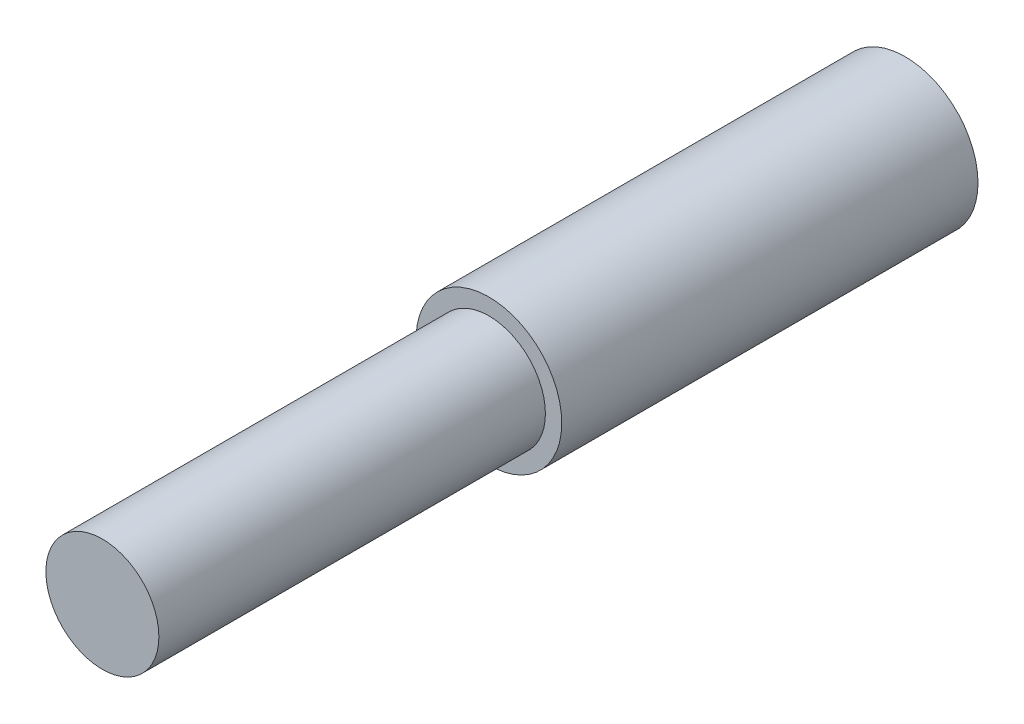
ISO-10303-21;
HEADER;
FILE_DESCRIPTION(('STEP AP214'),'2;1');
FILE_NAME('part.step','',(''),(''),'','','');
FILE_SCHEMA(('AUTOMOTIVE_DESIGN { 1 0 10303 214 1 1 1 1 }'));
ENDSEC;
DATA;
#1=APPLICATION_CONTEXT('core data for automotive mechanical design processes');
#2=APPLICATION_PROTOCOL_DEFINITION('international standard','automotive_design',2000,#1);
#3=PRODUCT_CONTEXT('',#1,'mechanical');
#4=PRODUCT('Part','Part','',(#3));
#5=PRODUCT_RELATED_PRODUCT_CATEGORY('part','',(#4));
#6=PRODUCT_DEFINITION_FORMATION('','',#4);
#7=PRODUCT_DEFINITION_CONTEXT('part definition',#1,'design');
#8=PRODUCT_DEFINITION('design','',#6,#7);
#9=PRODUCT_DEFINITION_SHAPE('','',#8);
#10=(LENGTH_UNIT() NAMED_UNIT(*) SI_UNIT(.MILLI.,.METRE.));
#11=(NAMED_UNIT(*) PLANE_ANGLE_UNIT() SI_UNIT($,.RADIAN.));
#12=(NAMED_UNIT(*) SI_UNIT($,.STERADIAN.) SOLID_ANGLE_UNIT());
#13=UNCERTAINTY_MEASURE_WITH_UNIT(LENGTH_MEASURE(1.E-05),#10,'distance_accuracy_value','');
#14=(GEOMETRIC_REPRESENTATION_CONTEXT(3) GLOBAL_UNCERTAINTY_ASSIGNED_CONTEXT((#13)) GLOBAL_UNIT_ASSIGNED_CONTEXT((#10,
#11,#12)) REPRESENTATION_CONTEXT('',''));
#15=CARTESIAN_POINT('',(0.,0.,0.));
#16=DIRECTION('',(0.,0.,1.));
#17=DIRECTION('',(1.,0.,0.));
#18=AXIS2_PLACEMENT_3D('',#15,#16,#17);
#19=CARTESIAN_POINT('',(0.,0.,35.56));
#20=DIRECTION('',(0.,0.,-1.));
#21=DIRECTION('',(-1.,0.,0.));
#22=AXIS2_PLACEMENT_3D('',#19,#20,#21);
#23=CYLINDRICAL_SURFACE('',#22,6.223);
#24=CARTESIAN_POINT('',(0.,0.,35.56));
#25=DIRECTION('',(0.,0.,1.));
#26=DIRECTION('',(1.,0.,0.));
#27=AXIS2_PLACEMENT_3D('',#24,#25,#26);
#28=CIRCLE('',#27,6.223);
#29=CARTESIAN_POINT('',(6.223,0.,35.56));
#30=VERTEX_POINT('',#29);
#31=EDGE_CURVE('E38',#30,#30,#28,.T.);
#32=ORIENTED_EDGE('',*,*,#31,.F.);
#33=EDGE_LOOP('',(#32));
#34=FACE_BOUND('',#33,.T.);
#35=CARTESIAN_POINT('',(0.,0.,0.));
#36=DIRECTION('',(0.,0.,1.));
#37=DIRECTION('',(1.,0.,0.));
#38=AXIS2_PLACEMENT_3D('',#35,#36,#37);
#39=CIRCLE('',#38,6.223);
#40=CARTESIAN_POINT('',(6.223,0.,0.));
#41=VERTEX_POINT('',#40);
#42=EDGE_CURVE('E34',#41,#41,#39,.T.);
#43=ORIENTED_EDGE('',*,*,#42,.T.);
#44=EDGE_LOOP('',(#43));
#45=FACE_BOUND('',#44,.T.);
#46=ADVANCED_FACE('F31',(#34,#45),#23,.T.);
#47=CARTESIAN_POINT('',(0.,0.,35.56));
#48=DIRECTION('',(0.,0.,1.));
#49=DIRECTION('',(1.,0.,0.));
#50=AXIS2_PLACEMENT_3D('',#47,#48,#49);
#51=PLANE('',#50);
#52=CARTESIAN_POINT('',(0.,0.,35.56));
#53=DIRECTION('',(0.,0.,1.));
#54=DIRECTION('',(1.,0.,0.));
#55=AXIS2_PLACEMENT_3D('',#52,#53,#54);
#56=CIRCLE('',#55,4.826);
#57=CARTESIAN_POINT('',(4.826,0.,35.56));
#58=VERTEX_POINT('',#57);
#59=EDGE_CURVE('E10',#58,#58,#56,.T.);
#60=ORIENTED_EDGE('',*,*,#59,.F.);
#61=EDGE_LOOP('',(#60));
#62=FACE_BOUND('',#61,.T.);
#63=ORIENTED_EDGE('',*,*,#31,.T.);
#64=EDGE_LOOP('',(#63));
#65=FACE_BOUND('',#64,.T.);
#66=ADVANCED_FACE('F55',(#62,#65),#51,.T.);
#67=CARTESIAN_POINT('',(0.,0.,0.));
#68=DIRECTION('',(0.,0.,1.));
#69=DIRECTION('',(1.,0.,0.));
#70=AXIS2_PLACEMENT_3D('',#67,#68,#69);
#71=PLANE('',#70);
#72=ORIENTED_EDGE('',*,*,#42,.F.);
#73=EDGE_LOOP('',(#72));
#74=FACE_BOUND('',#73,.T.);
#75=ADVANCED_FACE('F52',(#74),#71,.F.);
#76=CARTESIAN_POINT('',(0.,0.,68.58));
#77=DIRECTION('',(0.,0.,-1.));
#78=DIRECTION('',(-1.,0.,0.));
#79=AXIS2_PLACEMENT_3D('',#76,#77,#78);
#80=CYLINDRICAL_SURFACE('',#79,4.826);
#81=CARTESIAN_POINT('',(0.,0.,68.58));
#82=DIRECTION('',(0.,0.,1.));
#83=DIRECTION('',(1.,0.,0.));
#84=AXIS2_PLACEMENT_3D('',#81,#82,#83);
#85=CIRCLE('',#84,4.826);
#86=CARTESIAN_POINT('',(4.826,0.,68.58));
#87=VERTEX_POINT('',#86);
#88=EDGE_CURVE('E44',#87,#87,#85,.T.);
#89=ORIENTED_EDGE('',*,*,#88,.F.);
#90=EDGE_LOOP('',(#89));
#91=FACE_BOUND('',#90,.T.);
#92=ORIENTED_EDGE('',*,*,#59,.T.);
#93=EDGE_LOOP('',(#92));
#94=FACE_BOUND('',#93,.T.);
#95=ADVANCED_FACE('F54',(#91,#94),#80,.T.);
#96=CARTESIAN_POINT('',(0.,0.,68.58));
#97=DIRECTION('',(0.,0.,1.));
#98=DIRECTION('',(1.,0.,0.));
#99=AXIS2_PLACEMENT_3D('',#96,#97,#98);
#100=PLANE('',#99);
#101=ORIENTED_EDGE('',*,*,#88,.T.);
#102=EDGE_LOOP('',(#101));
#103=FACE_BOUND('',#102,.T.);
#104=ADVANCED_FACE('F60',(#103),#100,.T.);
#105=CLOSED_SHELL('',(#46,#66,#75,#95,#104));
#106=MANIFOLD_SOLID_BREP('B2',#105);
#107=ADVANCED_BREP_SHAPE_REPRESENTATION('',(#18,#106),#14);
#108=SHAPE_DEFINITION_REPRESENTATION(#9,#107);
ENDSEC;
END-ISO-10303-21;
